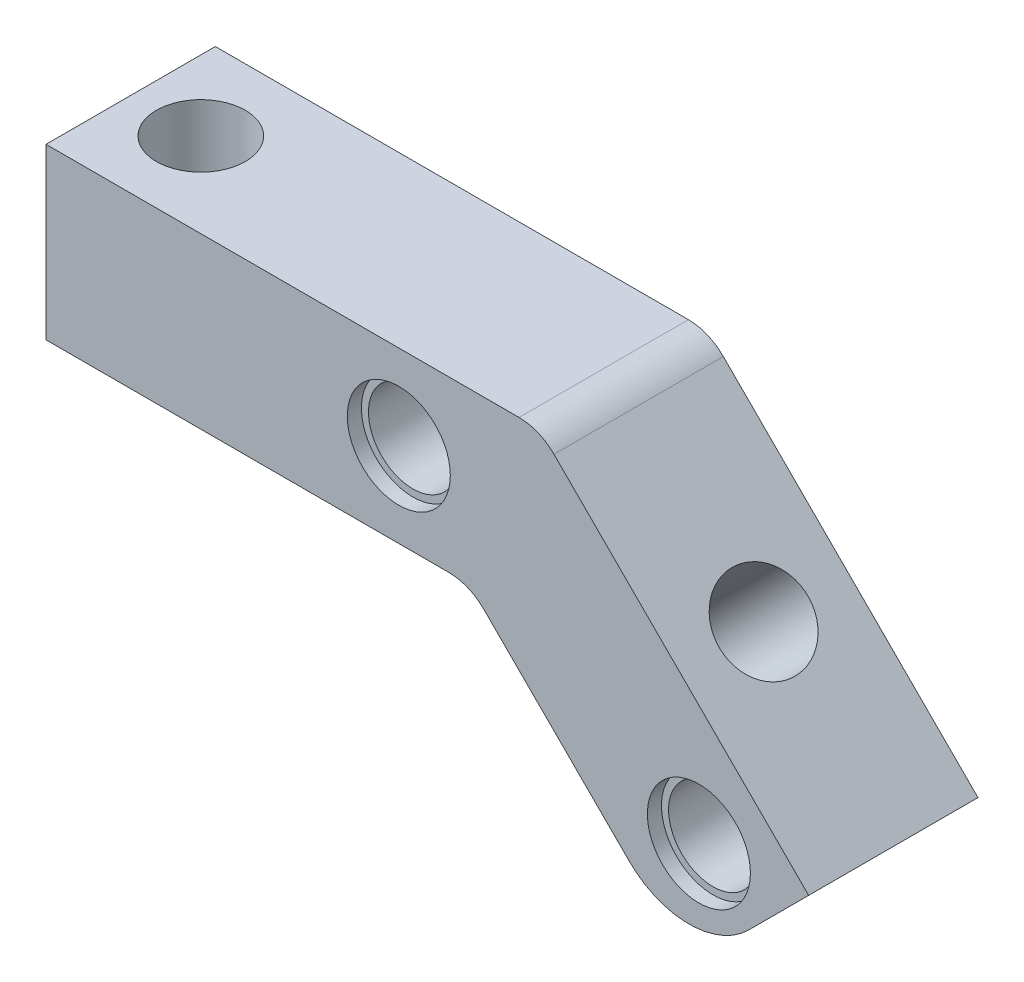
ISO-10303-21;
HEADER;
FILE_DESCRIPTION(('STEP AP214'),'2;1');
FILE_NAME('part.step','',(''),(''),'','','');
FILE_SCHEMA(('AUTOMOTIVE_DESIGN { 1 0 10303 214 1 1 1 1 }'));
ENDSEC;
DATA;
#1=APPLICATION_CONTEXT('core data for automotive mechanical design processes');
#2=APPLICATION_PROTOCOL_DEFINITION('international standard','automotive_design',2000,#1);
#3=PRODUCT_CONTEXT('',#1,'mechanical');
#4=PRODUCT('Part','Part','',(#3));
#5=PRODUCT_RELATED_PRODUCT_CATEGORY('part','',(#4));
#6=PRODUCT_DEFINITION_FORMATION('','',#4);
#7=PRODUCT_DEFINITION_CONTEXT('part definition',#1,'design');
#8=PRODUCT_DEFINITION('design','',#6,#7);
#9=PRODUCT_DEFINITION_SHAPE('','',#8);
#10=(LENGTH_UNIT() NAMED_UNIT(*) SI_UNIT(.MILLI.,.METRE.));
#11=(NAMED_UNIT(*) PLANE_ANGLE_UNIT() SI_UNIT($,.RADIAN.));
#12=(NAMED_UNIT(*) SI_UNIT($,.STERADIAN.) SOLID_ANGLE_UNIT());
#13=UNCERTAINTY_MEASURE_WITH_UNIT(LENGTH_MEASURE(1.E-05),#10,'distance_accuracy_value','');
#14=(GEOMETRIC_REPRESENTATION_CONTEXT(3) GLOBAL_UNCERTAINTY_ASSIGNED_CONTEXT((#13)) GLOBAL_UNIT_ASSIGNED_CONTEXT((#10,
#11,#12)) REPRESENTATION_CONTEXT('',''));
#15=CARTESIAN_POINT('',(0.,0.,0.));
#16=DIRECTION('',(0.,0.,1.));
#17=DIRECTION('',(1.,0.,0.));
#18=AXIS2_PLACEMENT_3D('',#15,#16,#17);
#19=CARTESIAN_POINT('',(4.97056274847714,-15.5563491861041,6.));
#20=DIRECTION('',(0.,1.,0.));
#21=DIRECTION('',(-1.,0.,0.));
#22=AXIS2_PLACEMENT_3D('',#19,#20,#21);
#23=CYLINDRICAL_SURFACE('',#22,3.15);
#24=CARTESIAN_POINT('',(4.97056274847714,12.,6.));
#25=DIRECTION('',(0.,-1.,0.));
#26=DIRECTION('',(1.,0.,0.));
#27=AXIS2_PLACEMENT_3D('',#24,#25,#26);
#28=CIRCLE('',#27,3.15);
#29=CARTESIAN_POINT('',(8.12056274847714,12.,6.));
#30=VERTEX_POINT('',#29);
#31=EDGE_CURVE('E139',#30,#30,#28,.T.);
#32=ORIENTED_EDGE('',*,*,#31,.F.);
#33=EDGE_LOOP('',(#32));
#34=FACE_BOUND('',#33,.T.);
#35=CARTESIAN_POINT('',(4.97056274847714,1.,6.));
#36=DIRECTION('',(0.,-1.,0.));
#37=DIRECTION('',(0.,0.,-1.));
#38=AXIS2_PLACEMENT_3D('',#35,#36,#37);
#39=CIRCLE('',#38,3.15);
#40=CARTESIAN_POINT('',(4.97056274847714,1.,2.85));
#41=VERTEX_POINT('',#40);
#42=EDGE_CURVE('E167',#41,#41,#39,.F.);
#43=ORIENTED_EDGE('',*,*,#42,.F.);
#44=EDGE_LOOP('',(#43));
#45=FACE_BOUND('',#44,.T.);
#46=ADVANCED_FACE('F32',(#34,#45),#23,.F.);
#47=CARTESIAN_POINT('',(36.3639610306789,-6.36396103067894,6.));
#48=DIRECTION('',(0.707106781186548,0.707106781186547,0.));
#49=DIRECTION('',(-0.707106781186547,0.707106781186548,0.));
#50=AXIS2_PLACEMENT_3D('',#47,#48,#49);
#51=CYLINDRICAL_SURFACE('',#50,3.15);
#52=CARTESIAN_POINT('',(44.8492424049175,2.12132034355962,6.));
#53=DIRECTION('',(0.707106781186548,0.707106781186547,0.));
#54=DIRECTION('',(-0.707106781186547,0.707106781186548,0.));
#55=AXIS2_PLACEMENT_3D('',#52,#53,#54);
#56=CIRCLE('',#55,3.15);
#57=CARTESIAN_POINT('',(42.6218560441799,4.34870670429725,6.));
#58=VERTEX_POINT('',#57);
#59=EDGE_CURVE('E142',#58,#58,#56,.T.);
#60=ORIENTED_EDGE('',*,*,#59,.T.);
#61=EDGE_LOOP('',(#60));
#62=FACE_BOUND('',#61,.T.);
#63=CARTESIAN_POINT('',(37.0710678118655,-5.6568542494924,6.));
#64=DIRECTION('',(-0.707106781186548,-0.707106781186547,0.));
#65=DIRECTION('',(0.707106781186547,-0.707106781186548,0.));
#66=AXIS2_PLACEMENT_3D('',#63,#64,#65);
#67=CIRCLE('',#66,3.15);
#68=CARTESIAN_POINT('',(39.2984541726031,-7.88424061023003,6.));
#69=VERTEX_POINT('',#68);
#70=EDGE_CURVE('E162',#69,#69,#67,.F.);
#71=ORIENTED_EDGE('',*,*,#70,.F.);
#72=EDGE_LOOP('',(#71));
#73=FACE_BOUND('',#72,.T.);
#74=ADVANCED_FACE('F269',(#62,#73),#51,.F.);
#75=CARTESIAN_POINT('',(46.2634559672906,-7.77817459305204,0.));
#76=DIRECTION('',(0.,0.,1.));
#77=DIRECTION('',(1.,0.,0.));
#78=AXIS2_PLACEMENT_3D('',#75,#76,#77);
#79=CYLINDRICAL_SURFACE('',#78,3.15);
#80=CARTESIAN_POINT('',(46.2634559672906,-7.77817459305204,11.));
#81=DIRECTION('',(0.,0.,1.));
#82=DIRECTION('',(1.,0.,0.));
#83=AXIS2_PLACEMENT_3D('',#80,#81,#82);
#84=CIRCLE('',#83,3.15);
#85=CARTESIAN_POINT('',(49.4134559672906,-7.77817459305204,11.));
#86=VERTEX_POINT('',#85);
#87=EDGE_CURVE('E147',#86,#86,#84,.F.);
#88=ORIENTED_EDGE('',*,*,#87,.F.);
#89=EDGE_LOOP('',(#88));
#90=FACE_BOUND('',#89,.T.);
#91=CARTESIAN_POINT('',(46.2634559672906,-7.77817459305204,1.));
#92=DIRECTION('',(0.,0.,-1.));
#93=DIRECTION('',(-1.,0.,0.));
#94=AXIS2_PLACEMENT_3D('',#91,#92,#93);
#95=CIRCLE('',#94,3.15);
#96=CARTESIAN_POINT('',(43.1134559672906,-7.77817459305204,1.));
#97=VERTEX_POINT('',#96);
#98=EDGE_CURVE('E157',#97,#97,#95,.F.);
#99=ORIENTED_EDGE('',*,*,#98,.F.);
#100=EDGE_LOOP('',(#99));
#101=FACE_BOUND('',#100,.T.);
#102=ADVANCED_FACE('F275',(#90,#101),#79,.F.);
#103=CARTESIAN_POINT('',(25.,6.,0.));
#104=DIRECTION('',(0.,0.,1.));
#105=DIRECTION('',(1.,0.,0.));
#106=AXIS2_PLACEMENT_3D('',#103,#104,#105);
#107=CYLINDRICAL_SURFACE('',#106,3.15);
#108=CARTESIAN_POINT('',(25.,6.,11.));
#109=DIRECTION('',(0.,0.,1.));
#110=DIRECTION('',(1.,0.,0.));
#111=AXIS2_PLACEMENT_3D('',#108,#109,#110);
#112=CIRCLE('',#111,3.15);
#113=CARTESIAN_POINT('',(28.15,6.,11.));
#114=VERTEX_POINT('',#113);
#115=EDGE_CURVE('E143',#114,#114,#112,.F.);
#116=ORIENTED_EDGE('',*,*,#115,.F.);
#117=EDGE_LOOP('',(#116));
#118=FACE_BOUND('',#117,.T.);
#119=CARTESIAN_POINT('',(25.,6.,1.));
#120=DIRECTION('',(0.,0.,-1.));
#121=DIRECTION('',(-1.,0.,0.));
#122=AXIS2_PLACEMENT_3D('',#119,#120,#121);
#123=CIRCLE('',#122,3.15);
#124=CARTESIAN_POINT('',(21.85,6.,1.));
#125=VERTEX_POINT('',#124);
#126=EDGE_CURVE('E152',#125,#125,#123,.F.);
#127=ORIENTED_EDGE('',*,*,#126,.F.);
#128=EDGE_LOOP('',(#127));
#129=FACE_BOUND('',#128,.T.);
#130=ADVANCED_FACE('F266',(#118,#129),#107,.F.);
#131=CARTESIAN_POINT('',(0.,12.,12.));
#132=DIRECTION('',(1.,0.,0.));
#133=DIRECTION('',(0.,1.,0.));
#134=AXIS2_PLACEMENT_3D('',#131,#132,#133);
#135=PLANE('',#134);
#136=DIRECTION('',(0.,-1.,0.));
#137=VECTOR('',#136,1.);
#138=CARTESIAN_POINT('',(0.,12.,0.));
#139=LINE('',#138,#137);
#140=CARTESIAN_POINT('',(0.,12.,0.));
#141=VERTEX_POINT('',#140);
#142=CARTESIAN_POINT('',(0.,0.,0.));
#143=VERTEX_POINT('',#142);
#144=EDGE_CURVE('E128',#141,#143,#139,.T.);
#145=ORIENTED_EDGE('',*,*,#144,.T.);
#146=DIRECTION('',(0.,0.,-1.));
#147=VECTOR('',#146,1.);
#148=CARTESIAN_POINT('',(0.,0.,12.));
#149=LINE('',#148,#147);
#150=CARTESIAN_POINT('',(0.,0.,12.));
#151=VERTEX_POINT('',#150);
#152=EDGE_CURVE('E108',#151,#143,#149,.T.);
#153=ORIENTED_EDGE('',*,*,#152,.F.);
#154=DIRECTION('',(0.,-1.,0.));
#155=VECTOR('',#154,1.);
#156=CARTESIAN_POINT('',(0.,12.,12.));
#157=LINE('',#156,#155);
#158=CARTESIAN_POINT('',(0.,12.,12.));
#159=VERTEX_POINT('',#158);
#160=EDGE_CURVE('E115',#159,#151,#157,.T.);
#161=ORIENTED_EDGE('',*,*,#160,.F.);
#162=DIRECTION('',(0.,0.,-1.));
#163=VECTOR('',#162,1.);
#164=CARTESIAN_POINT('',(0.,12.,12.));
#165=LINE('',#164,#163);
#166=EDGE_CURVE('E135',#159,#141,#165,.T.);
#167=ORIENTED_EDGE('',*,*,#166,.T.);
#168=EDGE_LOOP('',(#145,#153,#161,#167));
#169=FACE_BOUND('',#168,.T.);
#170=ADVANCED_FACE('F126',(#169),#135,.F.);
#171=CARTESIAN_POINT('',(0.,0.,12.));
#172=DIRECTION('',(0.,1.,0.));
#173=DIRECTION('',(0.,0.,1.));
#174=AXIS2_PLACEMENT_3D('',#171,#172,#173);
#175=PLANE('',#174);
#176=CARTESIAN_POINT('',(4.97056274847714,0.,6.));
#177=DIRECTION('',(0.,-1.,0.));
#178=DIRECTION('',(0.,0.,-1.));
#179=AXIS2_PLACEMENT_3D('',#176,#177,#178);
#180=CIRCLE('',#179,3.65);
#181=CARTESIAN_POINT('',(4.97056274847714,0.,2.35));
#182=VERTEX_POINT('',#181);
#183=EDGE_CURVE('E243',#182,#182,#180,.T.);
#184=ORIENTED_EDGE('',*,*,#183,.F.);
#185=EDGE_LOOP('',(#184));
#186=FACE_BOUND('',#185,.T.);
#187=DIRECTION('',(1.,0.,0.));
#188=VECTOR('',#187,1.);
#189=CARTESIAN_POINT('',(0.,0.,0.));
#190=LINE('',#189,#188);
#191=CARTESIAN_POINT('',(28.5502525316942,0.,0.));
#192=VERTEX_POINT('',#191);
#193=EDGE_CURVE('E205',#143,#192,#190,.T.);
#194=ORIENTED_EDGE('',*,*,#193,.T.);
#195=DIRECTION('',(0.,0.,-1.));
#196=VECTOR('',#195,1.);
#197=CARTESIAN_POINT('',(28.5502525316942,0.,12.));
#198=LINE('',#197,#196);
#199=CARTESIAN_POINT('',(28.5502525316942,0.,12.));
#200=VERTEX_POINT('',#199);
#201=EDGE_CURVE('E111',#192,#200,#198,.F.);
#202=ORIENTED_EDGE('',*,*,#201,.T.);
#203=DIRECTION('',(1.,0.,0.));
#204=VECTOR('',#203,1.);
#205=CARTESIAN_POINT('',(0.,0.,12.));
#206=LINE('',#205,#204);
#207=EDGE_CURVE('E103',#151,#200,#206,.T.);
#208=ORIENTED_EDGE('',*,*,#207,.F.);
#209=ORIENTED_EDGE('',*,*,#152,.T.);
#210=EDGE_LOOP('',(#194,#202,#208,#209));
#211=FACE_BOUND('',#210,.T.);
#212=ADVANCED_FACE('F106',(#186,#211),#175,.F.);
#213=CARTESIAN_POINT('',(30.,0.,12.));
#214=DIRECTION('',(0.707106781186548,0.707106781186547,0.));
#215=DIRECTION('',(-0.707106781186547,0.707106781186548,0.));
#216=AXIS2_PLACEMENT_3D('',#213,#214,#215);
#217=PLANE('',#216);
#218=CARTESIAN_POINT('',(36.3639610306789,-6.36396103067895,6.));
#219=DIRECTION('',(-0.707106781186548,-0.707106781186547,0.));
#220=DIRECTION('',(0.707106781186547,-0.707106781186548,0.));
#221=AXIS2_PLACEMENT_3D('',#218,#219,#220);
#222=CIRCLE('',#221,3.65);
#223=CARTESIAN_POINT('',(38.9449007820098,-8.94490078200985,6.));
#224=VERTEX_POINT('',#223);
#225=EDGE_CURVE('E169',#224,#224,#222,.T.);
#226=ORIENTED_EDGE('',*,*,#225,.F.);
#227=EDGE_LOOP('',(#226));
#228=FACE_BOUND('',#227,.T.);
#229=DIRECTION('',(0.707106781186547,-0.707106781186548,0.));
#230=VECTOR('',#229,1.);
#231=CARTESIAN_POINT('',(30.,0.,0.));
#232=LINE('',#231,#230);
#233=CARTESIAN_POINT('',(31.0251262658471,-1.02512626584709,0.));
#234=VERTEX_POINT('',#233);
#235=CARTESIAN_POINT('',(41.3137084989847,-11.3137084989848,0.));
#236=VERTEX_POINT('',#235);
#237=EDGE_CURVE('E202',#234,#236,#232,.T.);
#238=ORIENTED_EDGE('',*,*,#237,.T.);
#239=DIRECTION('',(0.,0.,-1.));
#240=VECTOR('',#239,1.);
#241=CARTESIAN_POINT('',(41.3137084989847,-11.3137084989848,12.));
#242=LINE('',#241,#240);
#243=CARTESIAN_POINT('',(41.3137084989847,-11.3137084989848,12.));
#244=VERTEX_POINT('',#243);
#245=EDGE_CURVE('E40',#236,#244,#242,.F.);
#246=ORIENTED_EDGE('',*,*,#245,.T.);
#247=DIRECTION('',(0.707106781186547,-0.707106781186548,0.));
#248=VECTOR('',#247,1.);
#249=CARTESIAN_POINT('',(30.,0.,12.));
#250=LINE('',#249,#248);
#251=CARTESIAN_POINT('',(31.0251262658471,-1.02512626584709,12.));
#252=VERTEX_POINT('',#251);
#253=EDGE_CURVE('E114',#252,#244,#250,.T.);
#254=ORIENTED_EDGE('',*,*,#253,.F.);
#255=DIRECTION('',(0.,0.,-1.));
#256=VECTOR('',#255,1.);
#257=CARTESIAN_POINT('',(31.0251262658471,-1.02512626584709,0.));
#258=LINE('',#257,#256);
#259=EDGE_CURVE('E129',#252,#234,#258,.T.);
#260=ORIENTED_EDGE('',*,*,#259,.T.);
#261=EDGE_LOOP('',(#238,#246,#254,#260));
#262=FACE_BOUND('',#261,.T.);
#263=ADVANCED_FACE('F218',(#228,#262),#217,.F.);
#264=CARTESIAN_POINT('',(45.556349186104,-15.5563491861041,12.));
#265=DIRECTION('',(-0.707106781186546,0.707106781186549,0.));
#266=DIRECTION('',(-0.707106781186549,-0.707106781186546,0.));
#267=AXIS2_PLACEMENT_3D('',#264,#265,#266);
#268=PLANE('',#267);
#269=DIRECTION('',(0.707106781186549,0.707106781186546,0.));
#270=VECTOR('',#269,1.);
#271=CARTESIAN_POINT('',(45.556349186104,-15.5563491861041,12.));
#272=LINE('',#271,#270);
#273=CARTESIAN_POINT('',(49.7989898732233,-11.3137084989848,12.));
#274=VERTEX_POINT('',#273);
#275=CARTESIAN_POINT('',(54.0416305603426,-7.07106781186551,12.));
#276=VERTEX_POINT('',#275);
#277=EDGE_CURVE('E195',#274,#276,#272,.T.);
#278=ORIENTED_EDGE('',*,*,#277,.F.);
#279=DIRECTION('',(0.,0.,-1.));
#280=VECTOR('',#279,1.);
#281=CARTESIAN_POINT('',(49.7989898732233,-11.3137084989848,12.));
#282=LINE('',#281,#280);
#283=CARTESIAN_POINT('',(49.7989898732233,-11.3137084989848,0.));
#284=VERTEX_POINT('',#283);
#285=EDGE_CURVE('E186',#274,#284,#282,.T.);
#286=ORIENTED_EDGE('',*,*,#285,.T.);
#287=DIRECTION('',(0.707106781186549,0.707106781186546,0.));
#288=VECTOR('',#287,1.);
#289=CARTESIAN_POINT('',(45.556349186104,-15.5563491861041,0.));
#290=LINE('',#289,#288);
#291=CARTESIAN_POINT('',(54.0416305603426,-7.07106781186551,0.));
#292=VERTEX_POINT('',#291);
#293=EDGE_CURVE('E194',#284,#292,#290,.T.);
#294=ORIENTED_EDGE('',*,*,#293,.T.);
#295=DIRECTION('',(0.,0.,-1.));
#296=VECTOR('',#295,1.);
#297=CARTESIAN_POINT('',(54.0416305603426,-7.07106781186551,12.));
#298=LINE('',#297,#296);
#299=EDGE_CURVE('E130',#276,#292,#298,.T.);
#300=ORIENTED_EDGE('',*,*,#299,.F.);
#301=EDGE_LOOP('',(#278,#286,#294,#300));
#302=FACE_BOUND('',#301,.T.);
#303=ADVANCED_FACE('F192',(#302),#268,.F.);
#304=CARTESIAN_POINT('',(54.0416305603426,-7.07106781186551,12.));
#305=DIRECTION('',(-0.707106781186548,-0.707106781186547,0.));
#306=DIRECTION('',(0.707106781186547,-0.707106781186548,0.));
#307=AXIS2_PLACEMENT_3D('',#304,#305,#306);
#308=PLANE('',#307);
#309=ORIENTED_EDGE('',*,*,#59,.F.);
#310=EDGE_LOOP('',(#309));
#311=FACE_BOUND('',#310,.T.);
#312=DIRECTION('',(-0.707106781186547,0.707106781186548,0.));
#313=VECTOR('',#312,1.);
#314=CARTESIAN_POINT('',(54.0416305603426,-7.07106781186551,0.));
#315=LINE('',#314,#313);
#316=CARTESIAN_POINT('',(35.9956890143242,10.9748737341529,0.));
#317=VERTEX_POINT('',#316);
#318=EDGE_CURVE('E201',#292,#317,#315,.T.);
#319=ORIENTED_EDGE('',*,*,#318,.T.);
#320=DIRECTION('',(0.,0.,-1.));
#321=VECTOR('',#320,1.);
#322=CARTESIAN_POINT('',(35.9956890143242,10.9748737341529,12.));
#323=LINE('',#322,#321);
#324=CARTESIAN_POINT('',(35.9956890143242,10.9748737341529,12.));
#325=VERTEX_POINT('',#324);
#326=EDGE_CURVE('E178',#317,#325,#323,.F.);
#327=ORIENTED_EDGE('',*,*,#326,.T.);
#328=DIRECTION('',(-0.707106781186547,0.707106781186548,0.));
#329=VECTOR('',#328,1.);
#330=CARTESIAN_POINT('',(54.0416305603426,-7.07106781186551,12.));
#331=LINE('',#330,#329);
#332=EDGE_CURVE('E209',#276,#325,#331,.T.);
#333=ORIENTED_EDGE('',*,*,#332,.F.);
#334=ORIENTED_EDGE('',*,*,#299,.T.);
#335=EDGE_LOOP('',(#319,#327,#333,#334));
#336=FACE_BOUND('',#335,.T.);
#337=ADVANCED_FACE('F300',(#311,#336),#308,.F.);
#338=CARTESIAN_POINT('',(34.9705627484771,12.,12.));
#339=DIRECTION('',(0.,-1.,0.));
#340=DIRECTION('',(1.,0.,0.));
#341=AXIS2_PLACEMENT_3D('',#338,#339,#340);
#342=PLANE('',#341);
#343=ORIENTED_EDGE('',*,*,#31,.T.);
#344=EDGE_LOOP('',(#343));
#345=FACE_BOUND('',#344,.T.);
#346=DIRECTION('',(-1.,0.,0.));
#347=VECTOR('',#346,1.);
#348=CARTESIAN_POINT('',(34.9705627484771,12.,12.));
#349=LINE('',#348,#347);
#350=CARTESIAN_POINT('',(33.5208152801713,12.,12.));
#351=VERTEX_POINT('',#350);
#352=EDGE_CURVE('E120',#351,#159,#349,.T.);
#353=ORIENTED_EDGE('',*,*,#352,.F.);
#354=DIRECTION('',(0.,0.,-1.));
#355=VECTOR('',#354,1.);
#356=CARTESIAN_POINT('',(33.5208152801713,12.,12.));
#357=LINE('',#356,#355);
#358=CARTESIAN_POINT('',(33.5208152801713,12.,0.));
#359=VERTEX_POINT('',#358);
#360=EDGE_CURVE('E173',#351,#359,#357,.T.);
#361=ORIENTED_EDGE('',*,*,#360,.T.);
#362=DIRECTION('',(-1.,0.,0.));
#363=VECTOR('',#362,1.);
#364=CARTESIAN_POINT('',(34.9705627484771,12.,0.));
#365=LINE('',#364,#363);
#366=EDGE_CURVE('E124',#359,#141,#365,.T.);
#367=ORIENTED_EDGE('',*,*,#366,.T.);
#368=ORIENTED_EDGE('',*,*,#166,.F.);
#369=EDGE_LOOP('',(#353,#361,#367,#368));
#370=FACE_BOUND('',#369,.T.);
#371=ADVANCED_FACE('F292',(#345,#370),#342,.F.);
#372=CARTESIAN_POINT('',(0.,0.,12.));
#373=DIRECTION('',(0.,0.,1.));
#374=DIRECTION('',(1.,0.,0.));
#375=AXIS2_PLACEMENT_3D('',#372,#373,#374);
#376=PLANE('',#375);
#377=CARTESIAN_POINT('',(46.2634559672906,-7.77817459305204,12.));
#378=DIRECTION('',(0.,0.,1.));
#379=DIRECTION('',(1.,0.,0.));
#380=AXIS2_PLACEMENT_3D('',#377,#378,#379);
#381=CIRCLE('',#380,3.65);
#382=CARTESIAN_POINT('',(49.9134559672906,-7.77817459305204,12.));
#383=VERTEX_POINT('',#382);
#384=EDGE_CURVE('E155',#383,#383,#381,.T.);
#385=ORIENTED_EDGE('',*,*,#384,.F.);
#386=EDGE_LOOP('',(#385));
#387=FACE_BOUND('',#386,.T.);
#388=CARTESIAN_POINT('',(25.,6.,12.));
#389=DIRECTION('',(0.,0.,1.));
#390=DIRECTION('',(1.,0.,0.));
#391=AXIS2_PLACEMENT_3D('',#388,#389,#390);
#392=CIRCLE('',#391,3.65);
#393=CARTESIAN_POINT('',(28.65,6.,12.));
#394=VERTEX_POINT('',#393);
#395=EDGE_CURVE('E150',#394,#394,#392,.T.);
#396=ORIENTED_EDGE('',*,*,#395,.F.);
#397=EDGE_LOOP('',(#396));
#398=FACE_BOUND('',#397,.T.);
#399=ORIENTED_EDGE('',*,*,#253,.T.);
#400=CARTESIAN_POINT('',(45.556349186104,-7.0710678118655,12.));
#401=DIRECTION('',(0.,0.,1.));
#402=DIRECTION('',(1.,0.,0.));
#403=AXIS2_PLACEMENT_3D('',#400,#401,#402);
#404=CIRCLE('',#403,6.);
#405=EDGE_CURVE('E11',#244,#274,#404,.T.);
#406=ORIENTED_EDGE('',*,*,#405,.T.);
#407=ORIENTED_EDGE('',*,*,#277,.T.);
#408=ORIENTED_EDGE('',*,*,#332,.T.);
#409=CARTESIAN_POINT('',(33.5208152801713,8.5,12.));
#410=DIRECTION('',(0.,0.,1.));
#411=DIRECTION('',(1.,0.,0.));
#412=AXIS2_PLACEMENT_3D('',#409,#410,#411);
#413=CIRCLE('',#412,3.5);
#414=EDGE_CURVE('E180',#325,#351,#413,.T.);
#415=ORIENTED_EDGE('',*,*,#414,.T.);
#416=ORIENTED_EDGE('',*,*,#352,.T.);
#417=ORIENTED_EDGE('',*,*,#160,.T.);
#418=ORIENTED_EDGE('',*,*,#207,.T.);
#419=CARTESIAN_POINT('',(28.5502525316942,-3.5,12.));
#420=DIRECTION('',(0.,0.,1.));
#421=DIRECTION('',(1.,0.,0.));
#422=AXIS2_PLACEMENT_3D('',#419,#420,#421);
#423=CIRCLE('',#422,3.5);
#424=EDGE_CURVE('E184',#200,#252,#423,.F.);
#425=ORIENTED_EDGE('',*,*,#424,.T.);
#426=EDGE_LOOP('',(#399,#406,#407,#408,#415,#416,#417,#418,#425));
#427=FACE_BOUND('',#426,.T.);
#428=ADVANCED_FACE('F118',(#387,#398,#427),#376,.T.);
#429=CARTESIAN_POINT('',(0.,0.,0.));
#430=DIRECTION('',(0.,0.,1.));
#431=DIRECTION('',(1.,0.,0.));
#432=AXIS2_PLACEMENT_3D('',#429,#430,#431);
#433=PLANE('',#432);
#434=CARTESIAN_POINT('',(46.2634559672906,-7.77817459305204,0.));
#435=DIRECTION('',(0.,0.,-1.));
#436=DIRECTION('',(-1.,0.,0.));
#437=AXIS2_PLACEMENT_3D('',#434,#435,#436);
#438=CIRCLE('',#437,3.65);
#439=CARTESIAN_POINT('',(42.6134559672906,-7.77817459305204,0.));
#440=VERTEX_POINT('',#439);
#441=EDGE_CURVE('E165',#440,#440,#438,.T.);
#442=ORIENTED_EDGE('',*,*,#441,.F.);
#443=EDGE_LOOP('',(#442));
#444=FACE_BOUND('',#443,.T.);
#445=CARTESIAN_POINT('',(25.,6.,0.));
#446=DIRECTION('',(0.,0.,-1.));
#447=DIRECTION('',(-1.,0.,0.));
#448=AXIS2_PLACEMENT_3D('',#445,#446,#447);
#449=CIRCLE('',#448,3.65);
#450=CARTESIAN_POINT('',(21.35,6.,0.));
#451=VERTEX_POINT('',#450);
#452=EDGE_CURVE('E160',#451,#451,#449,.T.);
#453=ORIENTED_EDGE('',*,*,#452,.F.);
#454=EDGE_LOOP('',(#453));
#455=FACE_BOUND('',#454,.T.);
#456=ORIENTED_EDGE('',*,*,#293,.F.);
#457=CARTESIAN_POINT('',(45.556349186104,-7.0710678118655,0.));
#458=DIRECTION('',(0.,0.,1.));
#459=DIRECTION('',(1.,0.,0.));
#460=AXIS2_PLACEMENT_3D('',#457,#458,#459);
#461=CIRCLE('',#460,6.);
#462=EDGE_CURVE('E54',#284,#236,#461,.F.);
#463=ORIENTED_EDGE('',*,*,#462,.T.);
#464=ORIENTED_EDGE('',*,*,#237,.F.);
#465=CARTESIAN_POINT('',(28.5502525316942,-3.5,0.));
#466=DIRECTION('',(0.,0.,1.));
#467=DIRECTION('',(1.,0.,0.));
#468=AXIS2_PLACEMENT_3D('',#465,#466,#467);
#469=CIRCLE('',#468,3.5);
#470=EDGE_CURVE('E182',#234,#192,#469,.T.);
#471=ORIENTED_EDGE('',*,*,#470,.T.);
#472=ORIENTED_EDGE('',*,*,#193,.F.);
#473=ORIENTED_EDGE('',*,*,#144,.F.);
#474=ORIENTED_EDGE('',*,*,#366,.F.);
#475=CARTESIAN_POINT('',(33.5208152801713,8.5,0.));
#476=DIRECTION('',(0.,0.,1.));
#477=DIRECTION('',(1.,0.,0.));
#478=AXIS2_PLACEMENT_3D('',#475,#476,#477);
#479=CIRCLE('',#478,3.5);
#480=EDGE_CURVE('E176',#359,#317,#479,.F.);
#481=ORIENTED_EDGE('',*,*,#480,.T.);
#482=ORIENTED_EDGE('',*,*,#318,.F.);
#483=EDGE_LOOP('',(#456,#463,#464,#471,#472,#473,#474,#481,#482));
#484=FACE_BOUND('',#483,.T.);
#485=ADVANCED_FACE('F199',(#444,#455,#484),#433,.F.);
#486=CARTESIAN_POINT('',(25.,6.,11.));
#487=DIRECTION('',(0.,0.,1.));
#488=DIRECTION('',(1.,0.,0.));
#489=AXIS2_PLACEMENT_3D('',#486,#487,#488);
#490=PLANE('',#489);
#491=CARTESIAN_POINT('',(25.,6.,11.));
#492=DIRECTION('',(0.,0.,1.));
#493=DIRECTION('',(1.,0.,0.));
#494=AXIS2_PLACEMENT_3D('',#491,#492,#493);
#495=CIRCLE('',#494,3.65);
#496=CARTESIAN_POINT('',(28.65,6.,11.));
#497=VERTEX_POINT('',#496);
#498=EDGE_CURVE('E146',#497,#497,#495,.T.);
#499=ORIENTED_EDGE('',*,*,#498,.T.);
#500=EDGE_LOOP('',(#499));
#501=FACE_BOUND('',#500,.T.);
#502=ORIENTED_EDGE('',*,*,#115,.T.);
#503=EDGE_LOOP('',(#502));
#504=FACE_BOUND('',#503,.T.);
#505=ADVANCED_FACE('F296',(#501,#504),#490,.T.);
#506=CARTESIAN_POINT('',(25.,6.,11.));
#507=DIRECTION('',(0.,0.,1.));
#508=DIRECTION('',(1.,0.,0.));
#509=AXIS2_PLACEMENT_3D('',#506,#507,#508);
#510=CYLINDRICAL_SURFACE('',#509,3.65);
#511=ORIENTED_EDGE('',*,*,#498,.F.);
#512=EDGE_LOOP('',(#511));
#513=FACE_BOUND('',#512,.T.);
#514=ORIENTED_EDGE('',*,*,#395,.T.);
#515=EDGE_LOOP('',(#514));
#516=FACE_BOUND('',#515,.T.);
#517=ADVANCED_FACE('F281',(#513,#516),#510,.F.);
#518=CARTESIAN_POINT('',(46.2634559672906,-7.77817459305204,11.));
#519=DIRECTION('',(0.,0.,1.));
#520=DIRECTION('',(1.,0.,0.));
#521=AXIS2_PLACEMENT_3D('',#518,#519,#520);
#522=PLANE('',#521);
#523=CARTESIAN_POINT('',(46.2634559672906,-7.77817459305204,11.));
#524=DIRECTION('',(0.,0.,1.));
#525=DIRECTION('',(1.,0.,0.));
#526=AXIS2_PLACEMENT_3D('',#523,#524,#525);
#527=CIRCLE('',#526,3.65);
#528=CARTESIAN_POINT('',(49.9134559672906,-7.77817459305204,11.));
#529=VERTEX_POINT('',#528);
#530=EDGE_CURVE('E151',#529,#529,#527,.T.);
#531=ORIENTED_EDGE('',*,*,#530,.T.);
#532=EDGE_LOOP('',(#531));
#533=FACE_BOUND('',#532,.T.);
#534=ORIENTED_EDGE('',*,*,#87,.T.);
#535=EDGE_LOOP('',(#534));
#536=FACE_BOUND('',#535,.T.);
#537=ADVANCED_FACE('F341',(#533,#536),#522,.T.);
#538=CARTESIAN_POINT('',(46.2634559672906,-7.77817459305204,11.));
#539=DIRECTION('',(0.,0.,1.));
#540=DIRECTION('',(1.,0.,0.));
#541=AXIS2_PLACEMENT_3D('',#538,#539,#540);
#542=CYLINDRICAL_SURFACE('',#541,3.65);
#543=ORIENTED_EDGE('',*,*,#530,.F.);
#544=EDGE_LOOP('',(#543));
#545=FACE_BOUND('',#544,.T.);
#546=ORIENTED_EDGE('',*,*,#384,.T.);
#547=EDGE_LOOP('',(#546));
#548=FACE_BOUND('',#547,.T.);
#549=ADVANCED_FACE('F348',(#545,#548),#542,.F.);
#550=CARTESIAN_POINT('',(25.,6.,1.));
#551=DIRECTION('',(0.,0.,-1.));
#552=DIRECTION('',(-1.,0.,0.));
#553=AXIS2_PLACEMENT_3D('',#550,#551,#552);
#554=PLANE('',#553);
#555=CARTESIAN_POINT('',(25.,6.,1.));
#556=DIRECTION('',(0.,0.,-1.));
#557=DIRECTION('',(-1.,0.,0.));
#558=AXIS2_PLACEMENT_3D('',#555,#556,#557);
#559=CIRCLE('',#558,3.65);
#560=CARTESIAN_POINT('',(21.35,6.,1.));
#561=VERTEX_POINT('',#560);
#562=EDGE_CURVE('E156',#561,#561,#559,.T.);
#563=ORIENTED_EDGE('',*,*,#562,.T.);
#564=EDGE_LOOP('',(#563));
#565=FACE_BOUND('',#564,.T.);
#566=ORIENTED_EDGE('',*,*,#126,.T.);
#567=EDGE_LOOP('',(#566));
#568=FACE_BOUND('',#567,.T.);
#569=ADVANCED_FACE('F356',(#565,#568),#554,.T.);
#570=CARTESIAN_POINT('',(25.,6.,1.));
#571=DIRECTION('',(0.,0.,-1.));
#572=DIRECTION('',(-1.,0.,0.));
#573=AXIS2_PLACEMENT_3D('',#570,#571,#572);
#574=CYLINDRICAL_SURFACE('',#573,3.65);
#575=ORIENTED_EDGE('',*,*,#562,.F.);
#576=EDGE_LOOP('',(#575));
#577=FACE_BOUND('',#576,.T.);
#578=ORIENTED_EDGE('',*,*,#452,.T.);
#579=EDGE_LOOP('',(#578));
#580=FACE_BOUND('',#579,.T.);
#581=ADVANCED_FACE('F365',(#577,#580),#574,.F.);
#582=CARTESIAN_POINT('',(46.2634559672906,-7.77817459305204,1.));
#583=DIRECTION('',(0.,0.,-1.));
#584=DIRECTION('',(-1.,0.,0.));
#585=AXIS2_PLACEMENT_3D('',#582,#583,#584);
#586=PLANE('',#585);
#587=CARTESIAN_POINT('',(46.2634559672906,-7.77817459305204,1.));
#588=DIRECTION('',(0.,0.,-1.));
#589=DIRECTION('',(-1.,0.,0.));
#590=AXIS2_PLACEMENT_3D('',#587,#588,#589);
#591=CIRCLE('',#590,3.65);
#592=CARTESIAN_POINT('',(42.6134559672906,-7.77817459305204,1.));
#593=VERTEX_POINT('',#592);
#594=EDGE_CURVE('E161',#593,#593,#591,.T.);
#595=ORIENTED_EDGE('',*,*,#594,.T.);
#596=EDGE_LOOP('',(#595));
#597=FACE_BOUND('',#596,.T.);
#598=ORIENTED_EDGE('',*,*,#98,.T.);
#599=EDGE_LOOP('',(#598));
#600=FACE_BOUND('',#599,.T.);
#601=ADVANCED_FACE('F374',(#597,#600),#586,.T.);
#602=CARTESIAN_POINT('',(46.2634559672906,-7.77817459305204,1.));
#603=DIRECTION('',(0.,0.,-1.));
#604=DIRECTION('',(-1.,0.,0.));
#605=AXIS2_PLACEMENT_3D('',#602,#603,#604);
#606=CYLINDRICAL_SURFACE('',#605,3.65);
#607=ORIENTED_EDGE('',*,*,#594,.F.);
#608=EDGE_LOOP('',(#607));
#609=FACE_BOUND('',#608,.T.);
#610=ORIENTED_EDGE('',*,*,#441,.T.);
#611=EDGE_LOOP('',(#610));
#612=FACE_BOUND('',#611,.T.);
#613=ADVANCED_FACE('F382',(#609,#612),#606,.F.);
#614=CARTESIAN_POINT('',(37.0710678118655,-5.6568542494924,6.));
#615=DIRECTION('',(-0.707106781186548,-0.707106781186547,0.));
#616=DIRECTION('',(0.707106781186547,-0.707106781186548,0.));
#617=AXIS2_PLACEMENT_3D('',#614,#615,#616);
#618=PLANE('',#617);
#619=CARTESIAN_POINT('',(37.0710678118655,-5.6568542494924,6.));
#620=DIRECTION('',(-0.707106781186548,-0.707106781186547,0.));
#621=DIRECTION('',(0.707106781186547,-0.707106781186548,0.));
#622=AXIS2_PLACEMENT_3D('',#619,#620,#621);
#623=CIRCLE('',#622,3.65);
#624=CARTESIAN_POINT('',(39.6520075631964,-8.2377940008233,6.));
#625=VERTEX_POINT('',#624);
#626=EDGE_CURVE('E166',#625,#625,#623,.T.);
#627=ORIENTED_EDGE('',*,*,#626,.T.);
#628=EDGE_LOOP('',(#627));
#629=FACE_BOUND('',#628,.T.);
#630=ORIENTED_EDGE('',*,*,#70,.T.);
#631=EDGE_LOOP('',(#630));
#632=FACE_BOUND('',#631,.T.);
#633=ADVANCED_FACE('F390',(#629,#632),#618,.T.);
#634=CARTESIAN_POINT('',(37.0710678118655,-5.6568542494924,6.));
#635=DIRECTION('',(-0.707106781186548,-0.707106781186547,0.));
#636=DIRECTION('',(0.707106781186547,-0.707106781186548,0.));
#637=AXIS2_PLACEMENT_3D('',#634,#635,#636);
#638=CYLINDRICAL_SURFACE('',#637,3.65);
#639=ORIENTED_EDGE('',*,*,#626,.F.);
#640=EDGE_LOOP('',(#639));
#641=FACE_BOUND('',#640,.T.);
#642=ORIENTED_EDGE('',*,*,#225,.T.);
#643=EDGE_LOOP('',(#642));
#644=FACE_BOUND('',#643,.T.);
#645=ADVANCED_FACE('F399',(#641,#644),#638,.F.);
#646=CARTESIAN_POINT('',(4.97056274847714,1.,6.));
#647=DIRECTION('',(0.,-1.,0.));
#648=DIRECTION('',(0.,0.,-1.));
#649=AXIS2_PLACEMENT_3D('',#646,#647,#648);
#650=PLANE('',#649);
#651=CARTESIAN_POINT('',(4.97056274847714,1.,6.));
#652=DIRECTION('',(0.,-1.,0.));
#653=DIRECTION('',(0.,0.,-1.));
#654=AXIS2_PLACEMENT_3D('',#651,#652,#653);
#655=CIRCLE('',#654,3.65);
#656=CARTESIAN_POINT('',(4.97056274847714,1.,2.35));
#657=VERTEX_POINT('',#656);
#658=EDGE_CURVE('E170',#657,#657,#655,.T.);
#659=ORIENTED_EDGE('',*,*,#658,.T.);
#660=EDGE_LOOP('',(#659));
#661=FACE_BOUND('',#660,.T.);
#662=ORIENTED_EDGE('',*,*,#42,.T.);
#663=EDGE_LOOP('',(#662));
#664=FACE_BOUND('',#663,.T.);
#665=ADVANCED_FACE('F249',(#661,#664),#650,.T.);
#666=CARTESIAN_POINT('',(4.97056274847714,1.,6.));
#667=DIRECTION('',(0.,-1.,0.));
#668=DIRECTION('',(0.,0.,-1.));
#669=AXIS2_PLACEMENT_3D('',#666,#667,#668);
#670=CYLINDRICAL_SURFACE('',#669,3.65);
#671=ORIENTED_EDGE('',*,*,#658,.F.);
#672=EDGE_LOOP('',(#671));
#673=FACE_BOUND('',#672,.T.);
#674=ORIENTED_EDGE('',*,*,#183,.T.);
#675=EDGE_LOOP('',(#674));
#676=FACE_BOUND('',#675,.T.);
#677=ADVANCED_FACE('F252',(#673,#676),#670,.F.);
#678=CARTESIAN_POINT('',(28.5502525316942,-3.5,12.));
#679=DIRECTION('',(0.,0.,1.));
#680=DIRECTION('',(1.,0.,0.));
#681=AXIS2_PLACEMENT_3D('',#678,#679,#680);
#682=CYLINDRICAL_SURFACE('',#681,3.5);
#683=ORIENTED_EDGE('',*,*,#424,.F.);
#684=ORIENTED_EDGE('',*,*,#201,.F.);
#685=ORIENTED_EDGE('',*,*,#470,.F.);
#686=ORIENTED_EDGE('',*,*,#259,.F.);
#687=EDGE_LOOP('',(#683,#684,#685,#686));
#688=FACE_BOUND('',#687,.T.);
#689=ADVANCED_FACE('F216',(#688),#682,.F.);
#690=CARTESIAN_POINT('',(33.5208152801713,8.5,12.));
#691=DIRECTION('',(0.,0.,-1.));
#692=DIRECTION('',(-1.,0.,0.));
#693=AXIS2_PLACEMENT_3D('',#690,#691,#692);
#694=CYLINDRICAL_SURFACE('',#693,3.5);
#695=ORIENTED_EDGE('',*,*,#414,.F.);
#696=ORIENTED_EDGE('',*,*,#326,.F.);
#697=ORIENTED_EDGE('',*,*,#480,.F.);
#698=ORIENTED_EDGE('',*,*,#360,.F.);
#699=EDGE_LOOP('',(#695,#696,#697,#698));
#700=FACE_BOUND('',#699,.T.);
#701=ADVANCED_FACE('F423',(#700),#694,.T.);
#702=CARTESIAN_POINT('',(45.556349186104,-7.0710678118655,12.));
#703=DIRECTION('',(0.,0.,-1.));
#704=DIRECTION('',(-1.,0.,0.));
#705=AXIS2_PLACEMENT_3D('',#702,#703,#704);
#706=CYLINDRICAL_SURFACE('',#705,6.);
#707=ORIENTED_EDGE('',*,*,#405,.F.);
#708=ORIENTED_EDGE('',*,*,#245,.F.);
#709=ORIENTED_EDGE('',*,*,#462,.F.);
#710=ORIENTED_EDGE('',*,*,#285,.F.);
#711=EDGE_LOOP('',(#707,#708,#709,#710));
#712=FACE_BOUND('',#711,.T.);
#713=ADVANCED_FACE('F34',(#712),#706,.T.);
#714=CLOSED_SHELL('',(#46,#74,#102,#130,#170,#212,#263,#303,#337,#371,#428,#485,#505,#517,#537,
#549,#569,#581,#601,#613,#633,#645,#665,#677,#689,#701,#713));
#715=MANIFOLD_SOLID_BREP('B2',#714);
#716=ADVANCED_BREP_SHAPE_REPRESENTATION('',(#18,#715),#14);
#717=SHAPE_DEFINITION_REPRESENTATION(#9,#716);
ENDSEC;
END-ISO-10303-21;
